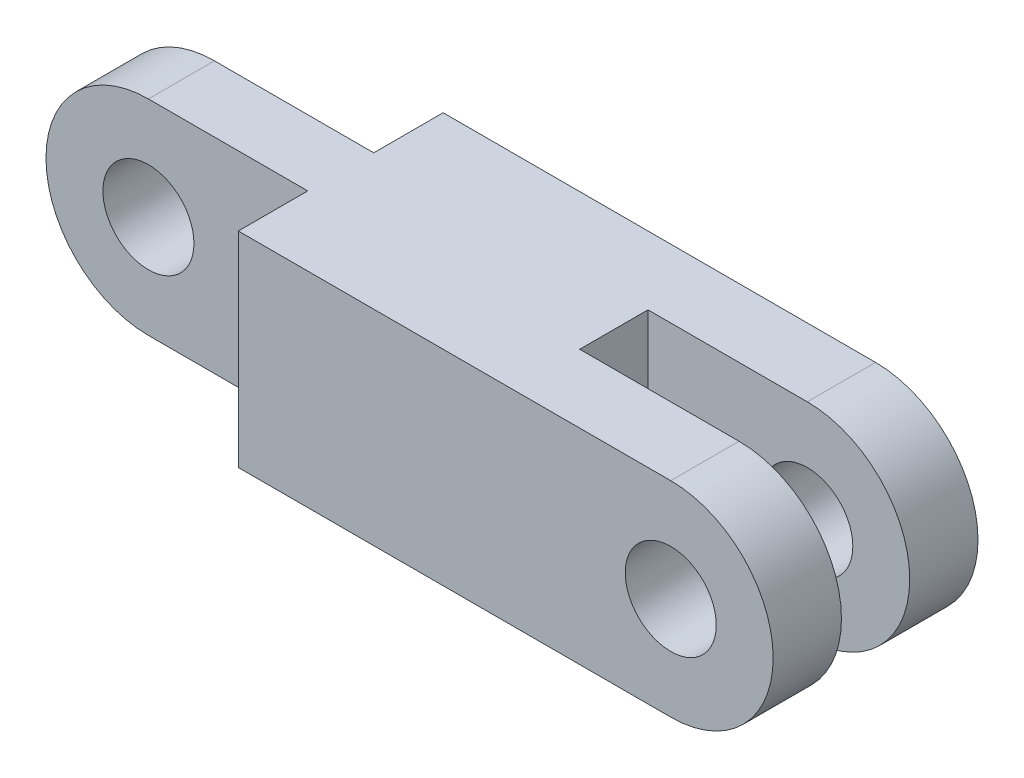
ISO-10303-21;
HEADER;
FILE_DESCRIPTION(('STEP AP214'),'2;1');
FILE_NAME('part.step','',(''),(''),'','','');
FILE_SCHEMA(('AUTOMOTIVE_DESIGN { 1 0 10303 214 1 1 1 1 }'));
ENDSEC;
DATA;
#1=APPLICATION_CONTEXT('core data for automotive mechanical design processes');
#2=APPLICATION_PROTOCOL_DEFINITION('international standard','automotive_design',2000,#1);
#3=PRODUCT_CONTEXT('',#1,'mechanical');
#4=PRODUCT('Part','Part','',(#3));
#5=PRODUCT_RELATED_PRODUCT_CATEGORY('part','',(#4));
#6=PRODUCT_DEFINITION_FORMATION('','',#4);
#7=PRODUCT_DEFINITION_CONTEXT('part definition',#1,'design');
#8=PRODUCT_DEFINITION('design','',#6,#7);
#9=PRODUCT_DEFINITION_SHAPE('','',#8);
#10=(LENGTH_UNIT() NAMED_UNIT(*) SI_UNIT(.MILLI.,.METRE.));
#11=(NAMED_UNIT(*) PLANE_ANGLE_UNIT() SI_UNIT($,.RADIAN.));
#12=(NAMED_UNIT(*) SI_UNIT($,.STERADIAN.) SOLID_ANGLE_UNIT());
#13=UNCERTAINTY_MEASURE_WITH_UNIT(LENGTH_MEASURE(1.E-05),#10,'distance_accuracy_value','');
#14=(GEOMETRIC_REPRESENTATION_CONTEXT(3) GLOBAL_UNCERTAINTY_ASSIGNED_CONTEXT((#13)) GLOBAL_UNIT_ASSIGNED_CONTEXT((#10,
#11,#12)) REPRESENTATION_CONTEXT('',''));
#15=CARTESIAN_POINT('',(0.,0.,0.));
#16=DIRECTION('',(0.,0.,1.));
#17=DIRECTION('',(1.,0.,0.));
#18=AXIS2_PLACEMENT_3D('',#15,#16,#17);
#19=CARTESIAN_POINT('',(0.,22.5,-7.25));
#20=DIRECTION('',(0.,1.,0.));
#21=DIRECTION('',(-1.,0.,0.));
#22=AXIS2_PLACEMENT_3D('',#19,#20,#21);
#23=PLANE('',#22);
#24=DIRECTION('',(0.,0.,1.));
#25=VECTOR('',#24,1.);
#26=CARTESIAN_POINT('',(-35.,22.5,-7.25));
#27=LINE('',#26,#25);
#28=CARTESIAN_POINT('',(-35.,22.5,-7.25));
#29=VERTEX_POINT('',#28);
#30=CARTESIAN_POINT('',(-35.,22.5,7.25));
#31=VERTEX_POINT('',#30);
#32=EDGE_CURVE('E35',#29,#31,#27,.T.);
#33=ORIENTED_EDGE('',*,*,#32,.T.);
#34=DIRECTION('',(-1.,0.,0.));
#35=VECTOR('',#34,1.);
#36=CARTESIAN_POINT('',(0.,22.5,7.25));
#37=LINE('',#36,#35);
#38=CARTESIAN_POINT('',(0.,22.5,7.25));
#39=VERTEX_POINT('',#38);
#40=EDGE_CURVE('E207',#39,#31,#37,.T.);
#41=ORIENTED_EDGE('',*,*,#40,.F.);
#42=DIRECTION('',(0.,0.,1.));
#43=VECTOR('',#42,1.);
#44=CARTESIAN_POINT('',(0.,22.5,22.5));
#45=LINE('',#44,#43);
#46=CARTESIAN_POINT('',(0.,22.5,22.5));
#47=VERTEX_POINT('',#46);
#48=EDGE_CURVE('E191',#39,#47,#45,.T.);
#49=ORIENTED_EDGE('',*,*,#48,.T.);
#50=DIRECTION('',(-1.,0.,0.));
#51=VECTOR('',#50,1.);
#52=CARTESIAN_POINT('',(60.,22.5,22.5));
#53=LINE('',#52,#51);
#54=CARTESIAN_POINT('',(95.,22.5,22.5));
#55=VERTEX_POINT('',#54);
#56=EDGE_CURVE('E135',#55,#47,#53,.T.);
#57=ORIENTED_EDGE('',*,*,#56,.F.);
#58=DIRECTION('',(0.,0.,-1.));
#59=VECTOR('',#58,1.);
#60=CARTESIAN_POINT('',(95.,22.5,22.5));
#61=LINE('',#60,#59);
#62=CARTESIAN_POINT('',(95.,22.5,7.5));
#63=VERTEX_POINT('',#62);
#64=EDGE_CURVE('E170',#55,#63,#61,.T.);
#65=ORIENTED_EDGE('',*,*,#64,.T.);
#66=DIRECTION('',(-1.,0.,0.));
#67=VECTOR('',#66,1.);
#68=CARTESIAN_POINT('',(95.,22.5,7.5));
#69=LINE('',#68,#67);
#70=CARTESIAN_POINT('',(60.,22.5,7.5));
#71=VERTEX_POINT('',#70);
#72=EDGE_CURVE('E164',#63,#71,#69,.T.);
#73=ORIENTED_EDGE('',*,*,#72,.T.);
#74=DIRECTION('',(0.,0.,1.));
#75=VECTOR('',#74,1.);
#76=CARTESIAN_POINT('',(60.,22.5,22.5));
#77=LINE('',#76,#75);
#78=CARTESIAN_POINT('',(60.,22.5,-7.49999999999999));
#79=VERTEX_POINT('',#78);
#80=EDGE_CURVE('E183',#79,#71,#77,.T.);
#81=ORIENTED_EDGE('',*,*,#80,.F.);
#82=DIRECTION('',(-1.,0.,0.));
#83=VECTOR('',#82,1.);
#84=CARTESIAN_POINT('',(95.,22.5,-7.5));
#85=LINE('',#84,#83);
#86=CARTESIAN_POINT('',(95.,22.5,-7.5));
#87=VERTEX_POINT('',#86);
#88=EDGE_CURVE('E46',#87,#79,#85,.T.);
#89=ORIENTED_EDGE('',*,*,#88,.F.);
#90=DIRECTION('',(0.,0.,1.));
#91=VECTOR('',#90,1.);
#92=CARTESIAN_POINT('',(95.,22.5,-22.5));
#93=LINE('',#92,#91);
#94=CARTESIAN_POINT('',(95.,22.5,-22.5));
#95=VERTEX_POINT('',#94);
#96=EDGE_CURVE('E137',#95,#87,#93,.T.);
#97=ORIENTED_EDGE('',*,*,#96,.F.);
#98=DIRECTION('',(-1.,0.,0.));
#99=VECTOR('',#98,1.);
#100=CARTESIAN_POINT('',(60.,22.5,-22.5));
#101=LINE('',#100,#99);
#102=CARTESIAN_POINT('',(0.,22.5,-22.5));
#103=VERTEX_POINT('',#102);
#104=EDGE_CURVE('E123',#95,#103,#101,.T.);
#105=ORIENTED_EDGE('',*,*,#104,.T.);
#106=CARTESIAN_POINT('',(0.,22.5,-7.24999999999999));
#107=VERTEX_POINT('',#106);
#108=EDGE_CURVE('E192',#103,#107,#45,.T.);
#109=ORIENTED_EDGE('',*,*,#108,.T.);
#110=DIRECTION('',(-1.,0.,0.));
#111=VECTOR('',#110,1.);
#112=CARTESIAN_POINT('',(0.,22.5,-7.25));
#113=LINE('',#112,#111);
#114=EDGE_CURVE('E220',#107,#29,#113,.T.);
#115=ORIENTED_EDGE('',*,*,#114,.T.);
#116=EDGE_LOOP('',(#33,#41,#49,#57,#65,#73,#81,#89,#97,#105,#109,#115));
#117=FACE_BOUND('',#116,.T.);
#118=ADVANCED_FACE('F32',(#117),#23,.T.);
#119=CARTESIAN_POINT('',(0.,-22.5,-7.25));
#120=DIRECTION('',(0.,-1.,0.));
#121=DIRECTION('',(1.,0.,0.));
#122=AXIS2_PLACEMENT_3D('',#119,#120,#121);
#123=PLANE('',#122);
#124=DIRECTION('',(1.,0.,0.));
#125=VECTOR('',#124,1.);
#126=CARTESIAN_POINT('',(0.,-22.5,-7.25));
#127=LINE('',#126,#125);
#128=CARTESIAN_POINT('',(-35.,-22.5,-7.25));
#129=VERTEX_POINT('',#128);
#130=CARTESIAN_POINT('',(0.,-22.5,-7.25));
#131=VERTEX_POINT('',#130);
#132=EDGE_CURVE('E226',#129,#131,#127,.T.);
#133=ORIENTED_EDGE('',*,*,#132,.T.);
#134=DIRECTION('',(0.,0.,-1.));
#135=VECTOR('',#134,1.);
#136=CARTESIAN_POINT('',(0.,-22.5,22.5));
#137=LINE('',#136,#135);
#138=CARTESIAN_POINT('',(0.,-22.5,-22.5));
#139=VERTEX_POINT('',#138);
#140=EDGE_CURVE('E196',#131,#139,#137,.T.);
#141=ORIENTED_EDGE('',*,*,#140,.T.);
#142=DIRECTION('',(-1.,0.,0.));
#143=VECTOR('',#142,1.);
#144=CARTESIAN_POINT('',(60.,-22.5,-22.5));
#145=LINE('',#144,#143);
#146=CARTESIAN_POINT('',(95.,-22.5,-22.5));
#147=VERTEX_POINT('',#146);
#148=EDGE_CURVE('E189',#147,#139,#145,.T.);
#149=ORIENTED_EDGE('',*,*,#148,.F.);
#150=DIRECTION('',(0.,0.,1.));
#151=VECTOR('',#150,1.);
#152=CARTESIAN_POINT('',(95.,-22.5,-22.5));
#153=LINE('',#152,#151);
#154=CARTESIAN_POINT('',(95.,-22.5,-7.5));
#155=VERTEX_POINT('',#154);
#156=EDGE_CURVE('E142',#147,#155,#153,.T.);
#157=ORIENTED_EDGE('',*,*,#156,.T.);
#158=DIRECTION('',(1.,0.,0.));
#159=VECTOR('',#158,1.);
#160=CARTESIAN_POINT('',(60.,-22.5,-7.5));
#161=LINE('',#160,#159);
#162=CARTESIAN_POINT('',(60.,-22.5,-7.5));
#163=VERTEX_POINT('',#162);
#164=EDGE_CURVE('E149',#163,#155,#161,.T.);
#165=ORIENTED_EDGE('',*,*,#164,.F.);
#166=DIRECTION('',(0.,0.,-1.));
#167=VECTOR('',#166,1.);
#168=CARTESIAN_POINT('',(60.,-22.5,22.5));
#169=LINE('',#168,#167);
#170=CARTESIAN_POINT('',(60.,-22.5,7.5));
#171=VERTEX_POINT('',#170);
#172=EDGE_CURVE('E185',#171,#163,#169,.T.);
#173=ORIENTED_EDGE('',*,*,#172,.F.);
#174=DIRECTION('',(1.,0.,0.));
#175=VECTOR('',#174,1.);
#176=CARTESIAN_POINT('',(60.,-22.5,7.5));
#177=LINE('',#176,#175);
#178=CARTESIAN_POINT('',(95.,-22.5,7.5));
#179=VERTEX_POINT('',#178);
#180=EDGE_CURVE('E54',#171,#179,#177,.T.);
#181=ORIENTED_EDGE('',*,*,#180,.T.);
#182=DIRECTION('',(0.,0.,-1.));
#183=VECTOR('',#182,1.);
#184=CARTESIAN_POINT('',(95.,-22.5,22.5));
#185=LINE('',#184,#183);
#186=CARTESIAN_POINT('',(95.,-22.5,22.5));
#187=VERTEX_POINT('',#186);
#188=EDGE_CURVE('E180',#187,#179,#185,.T.);
#189=ORIENTED_EDGE('',*,*,#188,.F.);
#190=DIRECTION('',(-1.,0.,0.));
#191=VECTOR('',#190,1.);
#192=CARTESIAN_POINT('',(60.,-22.5,22.5));
#193=LINE('',#192,#191);
#194=CARTESIAN_POINT('',(0.,-22.5,22.5));
#195=VERTEX_POINT('',#194);
#196=EDGE_CURVE('E200',#187,#195,#193,.T.);
#197=ORIENTED_EDGE('',*,*,#196,.T.);
#198=CARTESIAN_POINT('',(0.,-22.5,7.25));
#199=VERTEX_POINT('',#198);
#200=EDGE_CURVE('E186',#195,#199,#137,.T.);
#201=ORIENTED_EDGE('',*,*,#200,.T.);
#202=DIRECTION('',(1.,0.,0.));
#203=VECTOR('',#202,1.);
#204=CARTESIAN_POINT('',(0.,-22.5,7.25));
#205=LINE('',#204,#203);
#206=CARTESIAN_POINT('',(-35.,-22.5,7.25));
#207=VERTEX_POINT('',#206);
#208=EDGE_CURVE('E213',#207,#199,#205,.T.);
#209=ORIENTED_EDGE('',*,*,#208,.F.);
#210=DIRECTION('',(0.,0.,1.));
#211=VECTOR('',#210,1.);
#212=CARTESIAN_POINT('',(-35.,-22.5,-7.25));
#213=LINE('',#212,#211);
#214=EDGE_CURVE('E11',#129,#207,#213,.T.);
#215=ORIENTED_EDGE('',*,*,#214,.F.);
#216=EDGE_LOOP('',(#133,#141,#149,#157,#165,#173,#181,#189,#197,#201,#209,#215));
#217=FACE_BOUND('',#216,.T.);
#218=ADVANCED_FACE('F249',(#217),#123,.T.);
#219=CARTESIAN_POINT('',(-35.,0.,-7.25));
#220=DIRECTION('',(0.,0.,1.));
#221=DIRECTION('',(1.,0.,0.));
#222=AXIS2_PLACEMENT_3D('',#219,#220,#221);
#223=CYLINDRICAL_SURFACE('',#222,22.5);
#224=ORIENTED_EDGE('',*,*,#214,.T.);
#225=CARTESIAN_POINT('',(-35.,0.,7.25));
#226=DIRECTION('',(0.,0.,1.));
#227=DIRECTION('',(1.,0.,0.));
#228=AXIS2_PLACEMENT_3D('',#225,#226,#227);
#229=CIRCLE('',#228,22.5);
#230=EDGE_CURVE('E210',#31,#207,#229,.T.);
#231=ORIENTED_EDGE('',*,*,#230,.F.);
#232=ORIENTED_EDGE('',*,*,#32,.F.);
#233=CARTESIAN_POINT('',(-35.,0.,-7.25));
#234=DIRECTION('',(0.,0.,1.));
#235=DIRECTION('',(1.,0.,0.));
#236=AXIS2_PLACEMENT_3D('',#233,#234,#235);
#237=CIRCLE('',#236,22.5);
#238=EDGE_CURVE('E223',#29,#129,#237,.T.);
#239=ORIENTED_EDGE('',*,*,#238,.T.);
#240=EDGE_LOOP('',(#224,#231,#232,#239));
#241=FACE_BOUND('',#240,.T.);
#242=ADVANCED_FACE('F238',(#241),#223,.T.);
#243=CARTESIAN_POINT('',(-35.,0.,-7.25));
#244=DIRECTION('',(0.,0.,1.));
#245=DIRECTION('',(1.,0.,0.));
#246=AXIS2_PLACEMENT_3D('',#243,#244,#245);
#247=PLANE('',#246);
#248=CARTESIAN_POINT('',(-35.,0.,-7.25));
#249=DIRECTION('',(0.,0.,1.));
#250=DIRECTION('',(1.,0.,0.));
#251=AXIS2_PLACEMENT_3D('',#248,#249,#250);
#252=CIRCLE('',#251,10.);
#253=CARTESIAN_POINT('',(-25.,0.,-7.25));
#254=VERTEX_POINT('',#253);
#255=EDGE_CURVE('E217',#254,#254,#252,.T.);
#256=ORIENTED_EDGE('',*,*,#255,.T.);
#257=EDGE_LOOP('',(#256));
#258=FACE_BOUND('',#257,.T.);
#259=ORIENTED_EDGE('',*,*,#114,.F.);
#260=DIRECTION('',(0.,1.,0.));
#261=VECTOR('',#260,1.);
#262=CARTESIAN_POINT('',(0.,22.5,-7.25));
#263=LINE('',#262,#261);
#264=EDGE_CURVE('E228',#131,#107,#263,.T.);
#265=ORIENTED_EDGE('',*,*,#264,.F.);
#266=ORIENTED_EDGE('',*,*,#132,.F.);
#267=ORIENTED_EDGE('',*,*,#238,.F.);
#268=EDGE_LOOP('',(#259,#265,#266,#267));
#269=FACE_BOUND('',#268,.T.);
#270=ADVANCED_FACE('F285',(#258,#269),#247,.F.);
#271=CARTESIAN_POINT('',(-35.,0.,-7.25));
#272=DIRECTION('',(0.,0.,1.));
#273=DIRECTION('',(1.,0.,0.));
#274=AXIS2_PLACEMENT_3D('',#271,#272,#273);
#275=CYLINDRICAL_SURFACE('',#274,10.);
#276=ORIENTED_EDGE('',*,*,#255,.F.);
#277=EDGE_LOOP('',(#276));
#278=FACE_BOUND('',#277,.T.);
#279=CARTESIAN_POINT('',(-35.,0.,7.25));
#280=DIRECTION('',(0.,0.,1.));
#281=DIRECTION('',(1.,0.,0.));
#282=AXIS2_PLACEMENT_3D('',#279,#280,#281);
#283=CIRCLE('',#282,10.);
#284=CARTESIAN_POINT('',(-25.,0.,7.25));
#285=VERTEX_POINT('',#284);
#286=EDGE_CURVE('E134',#285,#285,#283,.T.);
#287=ORIENTED_EDGE('',*,*,#286,.T.);
#288=EDGE_LOOP('',(#287));
#289=FACE_BOUND('',#288,.T.);
#290=ADVANCED_FACE('F289',(#278,#289),#275,.F.);
#291=CARTESIAN_POINT('',(-35.,0.,7.25));
#292=DIRECTION('',(0.,0.,1.));
#293=DIRECTION('',(1.,0.,0.));
#294=AXIS2_PLACEMENT_3D('',#291,#292,#293);
#295=PLANE('',#294);
#296=ORIENTED_EDGE('',*,*,#40,.T.);
#297=ORIENTED_EDGE('',*,*,#230,.T.);
#298=ORIENTED_EDGE('',*,*,#208,.T.);
#299=DIRECTION('',(0.,1.,0.));
#300=VECTOR('',#299,1.);
#301=CARTESIAN_POINT('',(0.,22.5,7.25));
#302=LINE('',#301,#300);
#303=EDGE_CURVE('E215',#199,#39,#302,.T.);
#304=ORIENTED_EDGE('',*,*,#303,.T.);
#305=EDGE_LOOP('',(#296,#297,#298,#304));
#306=FACE_BOUND('',#305,.T.);
#307=ORIENTED_EDGE('',*,*,#286,.F.);
#308=EDGE_LOOP('',(#307));
#309=FACE_BOUND('',#308,.T.);
#310=ADVANCED_FACE('F241',(#306,#309),#295,.T.);
#311=CARTESIAN_POINT('',(0.,0.,0.));
#312=DIRECTION('',(-1.,0.,0.));
#313=DIRECTION('',(0.,-1.,0.));
#314=AXIS2_PLACEMENT_3D('',#311,#312,#313);
#315=PLANE('',#314);
#316=ORIENTED_EDGE('',*,*,#303,.F.);
#317=ORIENTED_EDGE('',*,*,#200,.F.);
#318=DIRECTION('',(0.,-1.,0.));
#319=VECTOR('',#318,1.);
#320=CARTESIAN_POINT('',(0.,-22.5,22.5));
#321=LINE('',#320,#319);
#322=EDGE_CURVE('E194',#47,#195,#321,.T.);
#323=ORIENTED_EDGE('',*,*,#322,.F.);
#324=ORIENTED_EDGE('',*,*,#48,.F.);
#325=EDGE_LOOP('',(#316,#317,#323,#324));
#326=FACE_BOUND('',#325,.T.);
#327=ADVANCED_FACE('F246',(#326),#315,.T.);
#328=CARTESIAN_POINT('',(60.,-22.5,-22.5));
#329=DIRECTION('',(0.,0.,1.));
#330=DIRECTION('',(1.,0.,0.));
#331=AXIS2_PLACEMENT_3D('',#328,#329,#330);
#332=PLANE('',#331);
#333=DIRECTION('',(0.,1.,0.));
#334=VECTOR('',#333,1.);
#335=CARTESIAN_POINT('',(0.,-22.5,-22.5));
#336=LINE('',#335,#334);
#337=EDGE_CURVE('E131',#139,#103,#336,.T.);
#338=ORIENTED_EDGE('',*,*,#337,.T.);
#339=ORIENTED_EDGE('',*,*,#104,.F.);
#340=CARTESIAN_POINT('',(95.,0.,-22.5));
#341=DIRECTION('',(0.,0.,1.));
#342=DIRECTION('',(-1.,0.,0.));
#343=AXIS2_PLACEMENT_3D('',#340,#341,#342);
#344=CIRCLE('',#343,22.5);
#345=EDGE_CURVE('E129',#147,#95,#344,.T.);
#346=ORIENTED_EDGE('',*,*,#345,.F.);
#347=ORIENTED_EDGE('',*,*,#148,.T.);
#348=EDGE_LOOP('',(#338,#339,#346,#347));
#349=FACE_BOUND('',#348,.T.);
#350=CARTESIAN_POINT('',(95.,0.,-22.5));
#351=DIRECTION('',(0.,0.,1.));
#352=DIRECTION('',(1.,0.,0.));
#353=AXIS2_PLACEMENT_3D('',#350,#351,#352);
#354=CIRCLE('',#353,9.99999999999999);
#355=CARTESIAN_POINT('',(105.,0.,-22.5));
#356=VERTEX_POINT('',#355);
#357=EDGE_CURVE('E157',#356,#356,#354,.T.);
#358=ORIENTED_EDGE('',*,*,#357,.T.);
#359=EDGE_LOOP('',(#358));
#360=FACE_BOUND('',#359,.T.);
#361=ADVANCED_FACE('F125',(#349,#360),#332,.F.);
#362=CARTESIAN_POINT('',(60.,-22.5,22.5));
#363=DIRECTION('',(0.,0.,-1.));
#364=DIRECTION('',(-1.,0.,0.));
#365=AXIS2_PLACEMENT_3D('',#362,#363,#364);
#366=PLANE('',#365);
#367=ORIENTED_EDGE('',*,*,#322,.T.);
#368=ORIENTED_EDGE('',*,*,#196,.F.);
#369=CARTESIAN_POINT('',(95.,0.,22.5));
#370=DIRECTION('',(0.,0.,1.));
#371=DIRECTION('',(-1.,0.,0.));
#372=AXIS2_PLACEMENT_3D('',#369,#370,#371);
#373=CIRCLE('',#372,22.5);
#374=EDGE_CURVE('E167',#187,#55,#373,.T.);
#375=ORIENTED_EDGE('',*,*,#374,.T.);
#376=ORIENTED_EDGE('',*,*,#56,.T.);
#377=EDGE_LOOP('',(#367,#368,#375,#376));
#378=FACE_BOUND('',#377,.T.);
#379=CARTESIAN_POINT('',(95.,0.,22.5));
#380=DIRECTION('',(0.,0.,1.));
#381=DIRECTION('',(1.,0.,0.));
#382=AXIS2_PLACEMENT_3D('',#379,#380,#381);
#383=CIRCLE('',#382,9.99999999999999);
#384=CARTESIAN_POINT('',(105.,0.,22.5));
#385=VERTEX_POINT('',#384);
#386=EDGE_CURVE('E161',#385,#385,#383,.T.);
#387=ORIENTED_EDGE('',*,*,#386,.F.);
#388=EDGE_LOOP('',(#387));
#389=FACE_BOUND('',#388,.T.);
#390=ADVANCED_FACE('F253',(#378,#389),#366,.F.);
#391=CARTESIAN_POINT('',(60.,0.,0.));
#392=DIRECTION('',(-1.,0.,0.));
#393=DIRECTION('',(0.,-1.,0.));
#394=AXIS2_PLACEMENT_3D('',#391,#392,#393);
#395=PLANE('',#394);
#396=ORIENTED_EDGE('',*,*,#172,.T.);
#397=DIRECTION('',(0.,-1.,0.));
#398=VECTOR('',#397,1.);
#399=CARTESIAN_POINT('',(60.,22.5,-7.5));
#400=LINE('',#399,#398);
#401=EDGE_CURVE('E146',#79,#163,#400,.T.);
#402=ORIENTED_EDGE('',*,*,#401,.F.);
#403=ORIENTED_EDGE('',*,*,#80,.T.);
#404=DIRECTION('',(0.,-1.,0.));
#405=VECTOR('',#404,1.);
#406=CARTESIAN_POINT('',(60.,22.5,7.5));
#407=LINE('',#406,#405);
#408=EDGE_CURVE('E174',#71,#171,#407,.T.);
#409=ORIENTED_EDGE('',*,*,#408,.T.);
#410=EDGE_LOOP('',(#396,#402,#403,#409));
#411=FACE_BOUND('',#410,.T.);
#412=ADVANCED_FACE('F262',(#411),#395,.F.);
#413=ORIENTED_EDGE('',*,*,#140,.F.);
#414=ORIENTED_EDGE('',*,*,#264,.T.);
#415=ORIENTED_EDGE('',*,*,#108,.F.);
#416=ORIENTED_EDGE('',*,*,#337,.F.);
#417=EDGE_LOOP('',(#413,#414,#415,#416));
#418=FACE_BOUND('',#417,.T.);
#419=ADVANCED_FACE('F300',(#418),#315,.T.);
#420=CARTESIAN_POINT('',(95.,0.,7.5));
#421=DIRECTION('',(0.,0.,-1.));
#422=DIRECTION('',(-1.,0.,0.));
#423=AXIS2_PLACEMENT_3D('',#420,#421,#422);
#424=PLANE('',#423);
#425=ORIENTED_EDGE('',*,*,#72,.F.);
#426=CARTESIAN_POINT('',(95.,0.,7.5));
#427=DIRECTION('',(0.,0.,1.));
#428=DIRECTION('',(-1.,0.,0.));
#429=AXIS2_PLACEMENT_3D('',#426,#427,#428);
#430=CIRCLE('',#429,22.5);
#431=EDGE_CURVE('E171',#179,#63,#430,.T.);
#432=ORIENTED_EDGE('',*,*,#431,.F.);
#433=ORIENTED_EDGE('',*,*,#180,.F.);
#434=ORIENTED_EDGE('',*,*,#408,.F.);
#435=EDGE_LOOP('',(#425,#432,#433,#434));
#436=FACE_BOUND('',#435,.T.);
#437=CARTESIAN_POINT('',(95.,0.,7.5));
#438=DIRECTION('',(0.,0.,1.));
#439=DIRECTION('',(1.,0.,0.));
#440=AXIS2_PLACEMENT_3D('',#437,#438,#439);
#441=CIRCLE('',#440,9.99999999999999);
#442=CARTESIAN_POINT('',(105.,0.,7.5));
#443=VERTEX_POINT('',#442);
#444=EDGE_CURVE('E141',#443,#443,#441,.T.);
#445=ORIENTED_EDGE('',*,*,#444,.T.);
#446=EDGE_LOOP('',(#445));
#447=FACE_BOUND('',#446,.T.);
#448=ADVANCED_FACE('F258',(#436,#447),#424,.T.);
#449=CARTESIAN_POINT('',(95.,0.,22.5));
#450=DIRECTION('',(0.,0.,-1.));
#451=DIRECTION('',(-1.,0.,0.));
#452=AXIS2_PLACEMENT_3D('',#449,#450,#451);
#453=CYLINDRICAL_SURFACE('',#452,22.5);
#454=ORIENTED_EDGE('',*,*,#431,.T.);
#455=ORIENTED_EDGE('',*,*,#64,.F.);
#456=ORIENTED_EDGE('',*,*,#374,.F.);
#457=ORIENTED_EDGE('',*,*,#188,.T.);
#458=EDGE_LOOP('',(#454,#455,#456,#457));
#459=FACE_BOUND('',#458,.T.);
#460=ADVANCED_FACE('F305',(#459),#453,.T.);
#461=CARTESIAN_POINT('',(95.,0.,22.5));
#462=DIRECTION('',(0.,0.,-1.));
#463=DIRECTION('',(-1.,0.,0.));
#464=AXIS2_PLACEMENT_3D('',#461,#462,#463);
#465=CYLINDRICAL_SURFACE('',#464,9.99999999999999);
#466=ORIENTED_EDGE('',*,*,#386,.T.);
#467=EDGE_LOOP('',(#466));
#468=FACE_BOUND('',#467,.T.);
#469=ORIENTED_EDGE('',*,*,#444,.F.);
#470=EDGE_LOOP('',(#469));
#471=FACE_BOUND('',#470,.T.);
#472=ADVANCED_FACE('F274',(#468,#471),#465,.F.);
#473=CARTESIAN_POINT('',(95.,0.,-22.5));
#474=DIRECTION('',(0.,0.,1.));
#475=DIRECTION('',(1.,0.,0.));
#476=AXIS2_PLACEMENT_3D('',#473,#474,#475);
#477=CYLINDRICAL_SURFACE('',#476,22.5);
#478=CARTESIAN_POINT('',(95.,0.,-7.5));
#479=DIRECTION('',(0.,0.,1.));
#480=DIRECTION('',(-1.,0.,0.));
#481=AXIS2_PLACEMENT_3D('',#478,#479,#480);
#482=CIRCLE('',#481,22.5);
#483=EDGE_CURVE('E156',#155,#87,#482,.T.);
#484=ORIENTED_EDGE('',*,*,#483,.F.);
#485=ORIENTED_EDGE('',*,*,#156,.F.);
#486=ORIENTED_EDGE('',*,*,#345,.T.);
#487=ORIENTED_EDGE('',*,*,#96,.T.);
#488=EDGE_LOOP('',(#484,#485,#486,#487));
#489=FACE_BOUND('',#488,.T.);
#490=ADVANCED_FACE('F145',(#489),#477,.T.);
#491=CARTESIAN_POINT('',(95.,0.,-7.5));
#492=DIRECTION('',(0.,0.,1.));
#493=DIRECTION('',(-1.,0.,0.));
#494=AXIS2_PLACEMENT_3D('',#491,#492,#493);
#495=PLANE('',#494);
#496=CARTESIAN_POINT('',(95.,0.,-7.5));
#497=DIRECTION('',(0.,0.,1.));
#498=DIRECTION('',(1.,0.,0.));
#499=AXIS2_PLACEMENT_3D('',#496,#497,#498);
#500=CIRCLE('',#499,9.99999999999999);
#501=CARTESIAN_POINT('',(105.,0.,-7.5));
#502=VERTEX_POINT('',#501);
#503=EDGE_CURVE('E153',#502,#502,#500,.T.);
#504=ORIENTED_EDGE('',*,*,#503,.F.);
#505=EDGE_LOOP('',(#504));
#506=FACE_BOUND('',#505,.T.);
#507=ORIENTED_EDGE('',*,*,#88,.T.);
#508=ORIENTED_EDGE('',*,*,#401,.T.);
#509=ORIENTED_EDGE('',*,*,#164,.T.);
#510=ORIENTED_EDGE('',*,*,#483,.T.);
#511=EDGE_LOOP('',(#507,#508,#509,#510));
#512=FACE_BOUND('',#511,.T.);
#513=ADVANCED_FACE('F263',(#506,#512),#495,.T.);
#514=CARTESIAN_POINT('',(95.,0.,-22.5));
#515=DIRECTION('',(0.,0.,1.));
#516=DIRECTION('',(1.,0.,0.));
#517=AXIS2_PLACEMENT_3D('',#514,#515,#516);
#518=CYLINDRICAL_SURFACE('',#517,9.99999999999999);
#519=ORIENTED_EDGE('',*,*,#357,.F.);
#520=EDGE_LOOP('',(#519));
#521=FACE_BOUND('',#520,.T.);
#522=ORIENTED_EDGE('',*,*,#503,.T.);
#523=EDGE_LOOP('',(#522));
#524=FACE_BOUND('',#523,.T.);
#525=ADVANCED_FACE('F265',(#521,#524),#518,.F.);
#526=CLOSED_SHELL('',(#118,#218,#242,#270,#290,#310,#327,#361,#390,#412,#419,#448,#460,#472,
#490,#513,#525));
#527=MANIFOLD_SOLID_BREP('B2',#526);
#528=ADVANCED_BREP_SHAPE_REPRESENTATION('',(#18,#527),#14);
#529=SHAPE_DEFINITION_REPRESENTATION(#9,#528);
ENDSEC;
END-ISO-10303-21;
